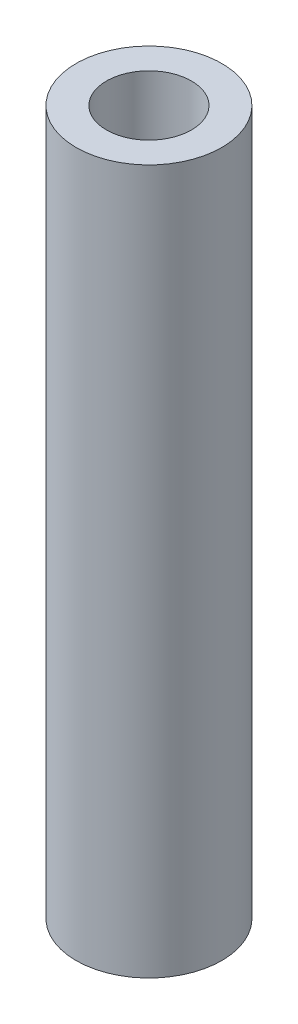
ISO-10303-21;
HEADER;
FILE_DESCRIPTION(('STEP AP214'),'2;1');
FILE_NAME('part.step','',(''),(''),'','','');
FILE_SCHEMA(('AUTOMOTIVE_DESIGN { 1 0 10303 214 1 1 1 1 }'));
ENDSEC;
DATA;
#1=APPLICATION_CONTEXT('core data for automotive mechanical design processes');
#2=APPLICATION_PROTOCOL_DEFINITION('international standard','automotive_design',2000,#1);
#3=PRODUCT_CONTEXT('',#1,'mechanical');
#4=PRODUCT('Part','Part','',(#3));
#5=PRODUCT_RELATED_PRODUCT_CATEGORY('part','',(#4));
#6=PRODUCT_DEFINITION_FORMATION('','',#4);
#7=PRODUCT_DEFINITION_CONTEXT('part definition',#1,'design');
#8=PRODUCT_DEFINITION('design','',#6,#7);
#9=PRODUCT_DEFINITION_SHAPE('','',#8);
#10=(LENGTH_UNIT() NAMED_UNIT(*) SI_UNIT(.MILLI.,.METRE.));
#11=(NAMED_UNIT(*) PLANE_ANGLE_UNIT() SI_UNIT($,.RADIAN.));
#12=(NAMED_UNIT(*) SI_UNIT($,.STERADIAN.) SOLID_ANGLE_UNIT());
#13=UNCERTAINTY_MEASURE_WITH_UNIT(LENGTH_MEASURE(1.E-05),#10,'distance_accuracy_value','');
#14=(GEOMETRIC_REPRESENTATION_CONTEXT(3) GLOBAL_UNCERTAINTY_ASSIGNED_CONTEXT((#13)) GLOBAL_UNIT_ASSIGNED_CONTEXT((#10,
#11,#12)) REPRESENTATION_CONTEXT('',''));
#15=CARTESIAN_POINT('',(0.,0.,0.));
#16=DIRECTION('',(0.,0.,1.));
#17=DIRECTION('',(1.,0.,0.));
#18=AXIS2_PLACEMENT_3D('',#15,#16,#17);
#19=CARTESIAN_POINT('',(0.,29.,0.));
#20=DIRECTION('',(0.,1.,0.));
#21=DIRECTION('',(0.,0.,1.));
#22=AXIS2_PLACEMENT_3D('',#19,#20,#21);
#23=PLANE('',#22);
#24=CARTESIAN_POINT('',(0.,29.,0.));
#25=DIRECTION('',(0.,1.,0.));
#26=DIRECTION('',(0.,0.,1.));
#27=AXIS2_PLACEMENT_3D('',#24,#25,#26);
#28=CIRCLE('',#27,3.);
#29=CARTESIAN_POINT('',(0.,29.,3.));
#30=VERTEX_POINT('',#29);
#31=EDGE_CURVE('E10',#30,#30,#28,.T.);
#32=ORIENTED_EDGE('',*,*,#31,.T.);
#33=EDGE_LOOP('',(#32));
#34=FACE_BOUND('',#33,.T.);
#35=CARTESIAN_POINT('',(0.,29.,0.));
#36=DIRECTION('',(0.,1.,0.));
#37=DIRECTION('',(0.,0.,1.));
#38=AXIS2_PLACEMENT_3D('',#35,#36,#37);
#39=CIRCLE('',#38,1.75);
#40=CARTESIAN_POINT('',(0.,29.,1.75));
#41=VERTEX_POINT('',#40);
#42=EDGE_CURVE('E42',#41,#41,#39,.T.);
#43=ORIENTED_EDGE('',*,*,#42,.F.);
#44=EDGE_LOOP('',(#43));
#45=FACE_BOUND('',#44,.T.);
#46=ADVANCED_FACE('F31',(#34,#45),#23,.T.);
#47=CARTESIAN_POINT('',(0.,0.,0.));
#48=DIRECTION('',(0.,1.,0.));
#49=DIRECTION('',(0.,0.,1.));
#50=AXIS2_PLACEMENT_3D('',#47,#48,#49);
#51=PLANE('',#50);
#52=CARTESIAN_POINT('',(0.,0.,0.));
#53=DIRECTION('',(0.,1.,0.));
#54=DIRECTION('',(0.,0.,1.));
#55=AXIS2_PLACEMENT_3D('',#52,#53,#54);
#56=CIRCLE('',#55,3.);
#57=CARTESIAN_POINT('',(0.,0.,3.));
#58=VERTEX_POINT('',#57);
#59=EDGE_CURVE('E35',#58,#58,#56,.T.);
#60=ORIENTED_EDGE('',*,*,#59,.F.);
#61=EDGE_LOOP('',(#60));
#62=FACE_BOUND('',#61,.T.);
#63=CARTESIAN_POINT('',(0.,0.,0.));
#64=DIRECTION('',(0.,1.,0.));
#65=DIRECTION('',(0.,0.,1.));
#66=AXIS2_PLACEMENT_3D('',#63,#64,#65);
#67=CIRCLE('',#66,1.75);
#68=CARTESIAN_POINT('',(0.,0.,1.75));
#69=VERTEX_POINT('',#68);
#70=EDGE_CURVE('E44',#69,#69,#67,.T.);
#71=ORIENTED_EDGE('',*,*,#70,.T.);
#72=EDGE_LOOP('',(#71));
#73=FACE_BOUND('',#72,.T.);
#74=ADVANCED_FACE('F54',(#62,#73),#51,.F.);
#75=CARTESIAN_POINT('',(0.,29.,0.));
#76=DIRECTION('',(0.,-1.,0.));
#77=DIRECTION('',(0.,0.,-1.));
#78=AXIS2_PLACEMENT_3D('',#75,#76,#77);
#79=CYLINDRICAL_SURFACE('',#78,3.);
#80=ORIENTED_EDGE('',*,*,#31,.F.);
#81=EDGE_LOOP('',(#80));
#82=FACE_BOUND('',#81,.T.);
#83=ORIENTED_EDGE('',*,*,#59,.T.);
#84=EDGE_LOOP('',(#83));
#85=FACE_BOUND('',#84,.T.);
#86=ADVANCED_FACE('F33',(#82,#85),#79,.T.);
#87=CARTESIAN_POINT('',(0.,29.,0.));
#88=DIRECTION('',(0.,-1.,0.));
#89=DIRECTION('',(0.,0.,-1.));
#90=AXIS2_PLACEMENT_3D('',#87,#88,#89);
#91=CYLINDRICAL_SURFACE('',#90,1.75);
#92=ORIENTED_EDGE('',*,*,#42,.T.);
#93=EDGE_LOOP('',(#92));
#94=FACE_BOUND('',#93,.T.);
#95=ORIENTED_EDGE('',*,*,#70,.F.);
#96=EDGE_LOOP('',(#95));
#97=FACE_BOUND('',#96,.T.);
#98=ADVANCED_FACE('F50',(#94,#97),#91,.F.);
#99=CLOSED_SHELL('',(#46,#74,#86,#98));
#100=MANIFOLD_SOLID_BREP('B2',#99);
#101=ADVANCED_BREP_SHAPE_REPRESENTATION('',(#18,#100),#14);
#102=SHAPE_DEFINITION_REPRESENTATION(#9,#101);
ENDSEC;
END-ISO-10303-21;
